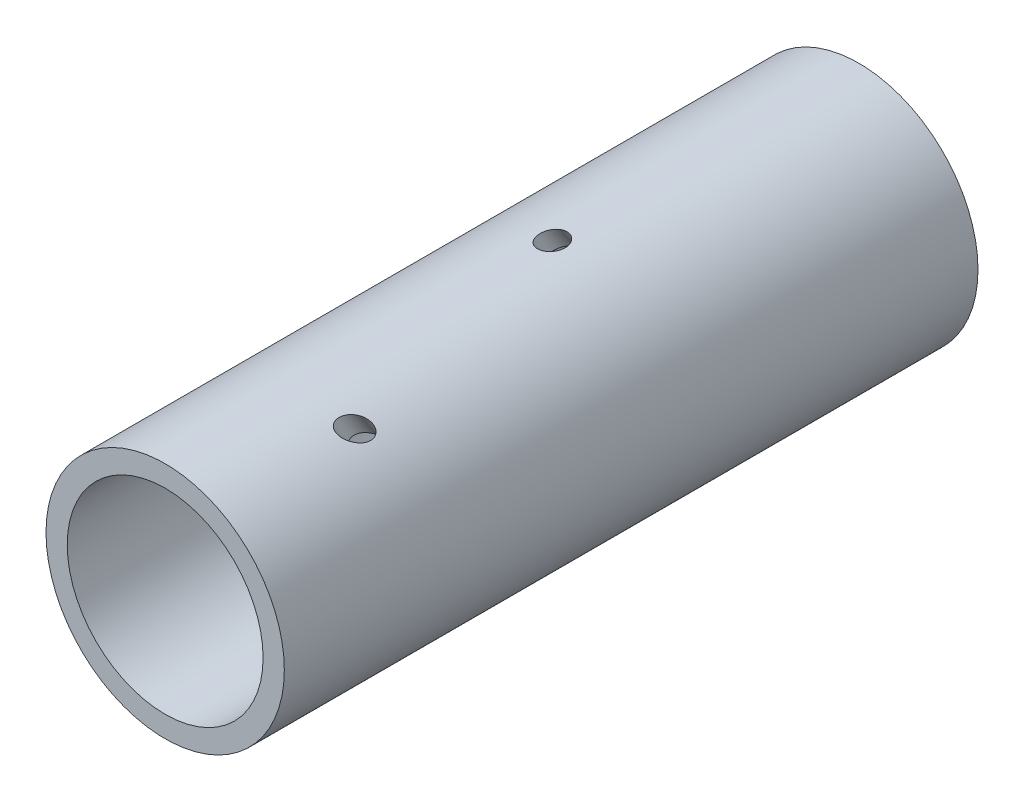
ISO-10303-21;
HEADER;
FILE_DESCRIPTION(('STEP AP214'),'2;1');
FILE_NAME('part.step','',(''),(''),'','','');
FILE_SCHEMA(('AUTOMOTIVE_DESIGN { 1 0 10303 214 1 1 1 1 }'));
ENDSEC;
DATA;
#1=APPLICATION_CONTEXT('core data for automotive mechanical design processes');
#2=APPLICATION_PROTOCOL_DEFINITION('international standard','automotive_design',2000,#1);
#3=PRODUCT_CONTEXT('',#1,'mechanical');
#4=PRODUCT('Part','Part','',(#3));
#5=PRODUCT_RELATED_PRODUCT_CATEGORY('part','',(#4));
#6=PRODUCT_DEFINITION_FORMATION('','',#4);
#7=PRODUCT_DEFINITION_CONTEXT('part definition',#1,'design');
#8=PRODUCT_DEFINITION('design','',#6,#7);
#9=PRODUCT_DEFINITION_SHAPE('','',#8);
#10=(LENGTH_UNIT() NAMED_UNIT(*) SI_UNIT(.MILLI.,.METRE.));
#11=(NAMED_UNIT(*) PLANE_ANGLE_UNIT() SI_UNIT($,.RADIAN.));
#12=(NAMED_UNIT(*) SI_UNIT($,.STERADIAN.) SOLID_ANGLE_UNIT());
#13=UNCERTAINTY_MEASURE_WITH_UNIT(LENGTH_MEASURE(1.E-05),#10,'distance_accuracy_value','');
#14=(GEOMETRIC_REPRESENTATION_CONTEXT(3) GLOBAL_UNCERTAINTY_ASSIGNED_CONTEXT((#13)) GLOBAL_UNIT_ASSIGNED_CONTEXT((#10,
#11,#12)) REPRESENTATION_CONTEXT('',''));
#15=CARTESIAN_POINT('',(0.,0.,0.));
#16=DIRECTION('',(0.,0.,1.));
#17=DIRECTION('',(1.,0.,0.));
#18=AXIS2_PLACEMENT_3D('',#15,#16,#17);
#19=CARTESIAN_POINT('',(0.,0.,-160.));
#20=DIRECTION('',(0.,0.,1.));
#21=DIRECTION('',(1.,0.,0.));
#22=AXIS2_PLACEMENT_3D('',#19,#20,#21);
#23=CYLINDRICAL_SURFACE('',#22,27.4847120291252);
#24=CARTESIAN_POINT('',(12.,24.7266939828991,-34.9456370238918));
#25=CARTESIAN_POINT('',(11.7955708249704,24.8258992898025,-34.8812020468948));
#26=CARTESIAN_POINT('',(11.5955446780501,24.9198092982787,-34.7932395773549));
#27=CARTESIAN_POINT('',(11.2109651697006,25.095195384678,-34.5784941975373));
#28=CARTESIAN_POINT('',(11.0264811015751,25.1766169830245,-34.4515480643789));
#29=CARTESIAN_POINT('',(10.6954998761636,25.3188628108949,-34.1798916483134));
#30=CARTESIAN_POINT('',(10.5470500342363,25.3809285034147,-34.0381874462833));
#31=CARTESIAN_POINT('',(10.269976929588,25.494300928506,-33.733263632902));
#32=CARTESIAN_POINT('',(10.1413274978308,25.5456218946599,-33.570072957874));
#33=CARTESIAN_POINT('',(9.88837173104402,25.6447004464521,-33.1997393759058));
#34=CARTESIAN_POINT('',(9.76764640163629,25.690753383683,-32.989679593373));
#35=CARTESIAN_POINT('',(9.55921491481743,25.7690368715095,-32.5509885763538));
#36=CARTESIAN_POINT('',(9.47155722202075,25.8012471435532,-32.3223306756956));
#37=CARTESIAN_POINT('',(9.33185583829653,25.8521094148291,-31.846386337746));
#38=CARTESIAN_POINT('',(9.28078041505836,25.8703935535314,-31.5987730182853));
#39=CARTESIAN_POINT('',(9.2233138395935,25.8909441069003,-31.0977749538082));
#40=CARTESIAN_POINT('',(9.2168341830568,25.8932422473153,-30.8444026418292));
#41=CARTESIAN_POINT('',(9.24830988124669,25.8820050510869,-30.4255473961526));
#42=CARTESIAN_POINT('',(9.2722183454226,25.8734762132452,-30.2588302903308));
#43=CARTESIAN_POINT('',(9.34469723681307,25.847390323043,-29.9315586531899));
#44=CARTESIAN_POINT('',(9.39322917747836,25.829847359238,-29.7709949240819));
#45=CARTESIAN_POINT('',(9.50492524362057,25.7889236181791,-29.4910533610005));
#46=CARTESIAN_POINT('',(9.56358762659526,25.7672738419107,-29.3696284583038));
#47=CARTESIAN_POINT('',(9.69867486437258,25.7167316844931,-29.1385256785147));
#48=CARTESIAN_POINT('',(9.77509211224047,25.6878424046382,-29.0288427999579));
#49=CARTESIAN_POINT('',(9.90267095742686,25.638810251719,-28.8763654380417));
#50=CARTESIAN_POINT('',(9.94759207860225,25.6214235494928,-28.8273510515158));
#51=CARTESIAN_POINT('',(10.0414583124602,25.5847815994874,-28.7341258656499));
#52=CARTESIAN_POINT('',(10.0904013471117,25.5655273157292,-28.689912612748));
#53=CARTESIAN_POINT('',(10.1919380144637,25.5252183367274,-28.6068686755786));
#54=CARTESIAN_POINT('',(10.2445298778981,25.5041645129228,-28.5680354096291));
#55=CARTESIAN_POINT('',(10.3528777409592,25.4603759115396,-28.4962122743712));
#56=CARTESIAN_POINT('',(10.408633308717,25.4376413632644,-28.4632216100264));
#57=CARTESIAN_POINT('',(10.5647461140931,25.3733509264549,-28.3814812851253));
#58=CARTESIAN_POINT('',(10.6677964657911,25.3302308399738,-28.3389435836878));
#59=CARTESIAN_POINT('',(10.8783773503723,25.2405114443628,-28.2734211497042));
#60=CARTESIAN_POINT('',(10.9859080036067,25.1939120417437,-28.2504369427659));
#61=CARTESIAN_POINT('',(11.2016476157382,25.098731132209,-28.2234018528171));
#62=CARTESIAN_POINT('',(11.3098492011861,25.0501624550321,-28.2192436649234));
#63=CARTESIAN_POINT('',(11.5249892848535,24.9519148283754,-28.2279518166846));
#64=CARTESIAN_POINT('',(11.6319271955642,24.9022353912971,-28.2408257832759));
#65=CARTESIAN_POINT('',(11.8937846137145,24.7785615099282,-28.291461031125));
#66=CARTESIAN_POINT('',(12.046903948498,24.7044245013548,-28.3382457884954));
#67=CARTESIAN_POINT('',(12.3431993551965,24.5577358566803,-28.4583478158386));
#68=CARTESIAN_POINT('',(12.4863498886673,24.4851885968545,-28.5317304448703));
#69=CARTESIAN_POINT('',(12.8145406835066,24.3154883871874,-28.7322129279527));
#70=CARTESIAN_POINT('',(12.9943237291229,24.2196916559873,-28.8691095953941));
#71=CARTESIAN_POINT('',(13.2463471017963,24.0822112190257,-29.0969994949733));
#72=CARTESIAN_POINT('',(13.3274772904965,24.0373830959166,-29.1768012951227));
#73=CARTESIAN_POINT('',(13.4838809747125,23.9499970083862,-29.3431183350693));
#74=CARTESIAN_POINT('',(13.5591550961517,23.9074388014991,-29.4296328554002));
#75=CARTESIAN_POINT('',(13.7801543421373,23.7812129377936,-29.7031030145794));
#76=CARTESIAN_POINT('',(13.9163924173563,23.7015601711072,-29.8997025205675));
#77=CARTESIAN_POINT('',(14.1627138464841,23.555199905367,-30.3130883987063));
#78=CARTESIAN_POINT('',(14.2727950331606,23.4884934790677,-30.5298764415109));
#79=CARTESIAN_POINT('',(14.415082763019,23.4012343288209,-30.8644526396012));
#80=CARTESIAN_POINT('',(14.4582935218309,23.3745442601898,-30.9760620836376));
#81=CARTESIAN_POINT('',(14.5373717355321,23.3254447931094,-31.2027601763979));
#82=CARTESIAN_POINT('',(14.5732383797131,23.3030358672687,-31.3178492076218));
#83=CARTESIAN_POINT('',(14.6688452637292,23.2430665079406,-31.6674421002643));
#84=CARTESIAN_POINT('',(14.7167963018549,23.2126371392349,-31.9067429441766));
#85=CARTESIAN_POINT('',(14.765252041185,23.1818297480203,-32.3186374234289));
#86=CARTESIAN_POINT('',(14.7756957745772,23.1751618774581,-32.4896202978354));
#87=CARTESIAN_POINT('',(14.7742355116691,23.1760963796053,-32.8315186936626));
#88=CARTESIAN_POINT('',(14.7623669178112,23.1836761459234,-33.0024338921303));
#89=CARTESIAN_POINT('',(14.7177427703326,23.2120216354176,-33.3044668115145));
#90=CARTESIAN_POINT('',(14.6897635610048,23.2297683930794,-33.4365653084111));
#91=CARTESIAN_POINT('',(14.6157013885103,23.2764387772188,-33.6937034872516));
#92=CARTESIAN_POINT('',(14.5696291433585,23.3053557864588,-33.8187472982117));
#93=CARTESIAN_POINT('',(14.4863314636669,23.3571541470674,-33.9977918934698));
#94=CARTESIAN_POINT('',(14.4560310361939,23.3759283405731,-34.0562981154197));
#95=CARTESIAN_POINT('',(14.3907641329581,23.4161648992198,-34.1696560734085));
#96=CARTESIAN_POINT('',(14.3557999639054,23.437625935115,-34.2245095961106));
#97=CARTESIAN_POINT('',(14.2813769436791,23.483048400002,-34.3299531352142));
#98=CARTESIAN_POINT('',(14.2419190772075,23.5070092811078,-34.3805440814609));
#99=CARTESIAN_POINT('',(14.1588186398716,23.55715626362,-34.4769276809257));
#100=CARTESIAN_POINT('',(14.115176541628,23.5833421136721,-34.5227208748433));
#101=CARTESIAN_POINT('',(13.9900123666801,23.6579265985789,-34.6413422045742));
#102=CARTESIAN_POINT('',(13.9045271555583,23.708318296418,-34.708841932907));
#103=CARTESIAN_POINT('',(13.7245452229196,23.8129605248731,-34.8263796806803));
#104=CARTESIAN_POINT('',(13.6300484220337,23.8672110894748,-34.8764175463083));
#105=CARTESIAN_POINT('',(13.4335635946111,23.9783580646483,-34.9594211200534));
#106=CARTESIAN_POINT('',(13.3314962721449,24.0352791772272,-34.9921641020596));
#107=CARTESIAN_POINT('',(13.1235382734901,24.1494562533742,-35.0403304941527));
#108=CARTESIAN_POINT('',(13.0176450101173,24.2067124207267,-35.0557419491596));
#109=CARTESIAN_POINT('',(12.7887300493108,24.3285211243894,-35.0714990831533));
#110=CARTESIAN_POINT('',(12.6654605919391,24.3929213488688,-35.06932266079));
#111=CARTESIAN_POINT('',(12.419566716489,24.5190300152509,-35.045868380455));
#112=CARTESIAN_POINT('',(12.2969418192183,24.5807408185037,-35.0246076481223));
#113=CARTESIAN_POINT('',(12.1167764737964,24.6697686488168,-34.9804242457842));
#114=CARTESIAN_POINT('',(12.0582097414888,24.6984459832272,-34.9639844214845));
#115=CARTESIAN_POINT('',(12.,24.7266939828991,-34.9456370238918));
#116=B_SPLINE_CURVE_WITH_KNOTS('',3,(#24,#25,#26,#27,#28,#29,#30,#31,#32,#33,#34,#35,#36,#37,
#38,#39,#40,#41,#42,#43,#44,#45,#46,#47,#48,#49,#50,#51,#52,#53,#54,#55,#56,#57,#58,#59,#60,#61,
#62,#63,#64,#65,#66,#67,#68,#69,#70,#71,#72,#73,#74,#75,#76,#77,#78,#79,#80,#81,#82,#83,#84,#85,
#86,#87,#88,#89,#90,#91,#92,#93,#94,#95,#96,#97,#98,#99,#100,#101,#102,#103,#104,#105,#106,#107,
#108,#109,#110,#111,#112,#113,#114,#115),.UNSPECIFIED.,.T.,.F.,(4,2,2,2,2,2,2,2,2,2,2,2,2,2,2,2,
2,2,2,2,2,2,2,2,2,2,2,2,2,2,2,2,2,2,2,2,2,2,2,2,2,2,2,2,2,4),(0.,0.708329155830534,
1.41966545163005,2.06052589135333,2.70053193267752,3.43705824586125,4.17465987168699,
4.93112757940473,5.68609357490438,6.19024755863515,6.69361596496059,7.10180729555275,
7.5098240611697,7.71572779273169,7.92152579947564,8.12722470578747,8.33289559992982,
8.68956130736689,9.04623660185228,9.40087633141199,9.75567492110521,10.282019644625,
10.8096666245821,11.5417350657747,11.9084219702008,12.2750696274285,13.0286586296692,
13.7823100488676,14.1498655268837,14.5174615570757,15.2510829010945,15.7638014053779,
16.2757070778647,16.6827567741881,17.0895657038662,17.2948347115928,17.5000025661247,
17.7051255485062,17.9102253889113,18.2683884520687,18.6265546700212,18.9892273918821,
19.3521501278991,19.7679480317669,20.1833731847253,20.3850648319369),.UNSPECIFIED.);
#117=CARTESIAN_POINT('',(12.,24.7266939828991,-34.9456370238918));
#118=VERTEX_POINT('',#117);
#119=EDGE_CURVE('E75',#118,#118,#116,.T.);
#120=ORIENTED_EDGE('',*,*,#119,.F.);
#121=EDGE_LOOP('',(#120));
#122=FACE_BOUND('',#121,.T.);
#123=CARTESIAN_POINT('',(0.,27.4847120291252,-92.6858449496621));
#124=CARTESIAN_POINT('',(-0.146551207208986,27.4847107952847,-92.6858382949386));
#125=CARTESIAN_POINT('',(-0.293356246275081,27.4835253918456,-92.6731226789664));
#126=CARTESIAN_POINT('',(-0.582812829421428,27.4789155068457,-92.6227567891551));
#127=CARTESIAN_POINT('',(-0.725452847520742,27.4754853324695,-92.5850431162557));
#128=CARTESIAN_POINT('',(-1.00192944488051,27.4667910296521,-92.4864265997963));
#129=CARTESIAN_POINT('',(-1.13579094359879,27.4615323856443,-92.4255930533221));
#130=CARTESIAN_POINT('',(-1.39178819800885,27.4497499245402,-92.2832179156056));
#131=CARTESIAN_POINT('',(-1.51392893590623,27.4432266486012,-92.2016851772898));
#132=CARTESIAN_POINT('',(-1.74865774712732,27.4292904397175,-92.0172779068338));
#133=CARTESIAN_POINT('',(-1.86068328660558,27.4218526485745,-91.9136917635453));
#134=CARTESIAN_POINT('',(-2.06777464365778,27.4070156566451,-91.6907929868975));
#135=CARTESIAN_POINT('',(-2.16283324678167,27.3996164735672,-91.5714737010217));
#136=CARTESIAN_POINT('',(-2.34426097292143,27.3847222986895,-91.3070514039489));
#137=CARTESIAN_POINT('',(-2.42860238803292,27.3773022611776,-91.1605555512414));
#138=CARTESIAN_POINT('',(-2.57488411427528,27.3639317778745,-90.85674837633));
#139=CARTESIAN_POINT('',(-2.636813298324,27.3579820625232,-90.6994317278836));
#140=CARTESIAN_POINT('',(-2.74533999002296,27.3473199194071,-90.3558966240522));
#141=CARTESIAN_POINT('',(-2.78871771891717,27.342884852792,-90.1686526170321));
#142=CARTESIAN_POINT('',(-2.8475284761413,27.3368217127966,-89.7898086481029));
#143=CARTESIAN_POINT('',(-2.86294821944162,27.3351949738905,-89.5982066591367));
#144=CARTESIAN_POINT('',(-2.86690986239638,27.3347814174029,-89.1898313431235));
#145=CARTESIAN_POINT('',(-2.85170662853498,27.336390269477,-88.9730161891119));
#146=CARTESIAN_POINT('',(-2.78764209249116,27.3429964069701,-88.5442884813147));
#147=CARTESIAN_POINT('',(-2.73874737599309,27.3479970562062,-88.3323810106871));
#148=CARTESIAN_POINT('',(-2.60363007920297,27.3612033352,-87.9058105441133));
#149=CARTESIAN_POINT('',(-2.5152189912789,27.3695935843023,-87.6918390084227));
#150=CARTESIAN_POINT('',(-2.30107908355317,27.3884273283071,-87.2835397199876));
#151=CARTESIAN_POINT('',(-2.17540322763378,27.3988679020477,-87.0891846086931));
#152=CARTESIAN_POINT('',(-1.92795161692218,27.4172042646745,-86.7805955716831));
#153=CARTESIAN_POINT('',(-1.8150496190552,27.4249884377208,-86.6592142825406));
#154=CARTESIAN_POINT('',(-1.57103846432102,27.4400458639739,-86.4363517369935));
#155=CARTESIAN_POINT('',(-1.43995586738585,27.4473198395974,-86.3348419628302));
#156=CARTESIAN_POINT('',(-1.18341955009049,27.4594736316788,-86.1710801241865));
#157=CARTESIAN_POINT('',(-1.06032019291999,27.4645500564261,-86.1051652553994));
#158=CARTESIAN_POINT('',(-0.804788853679,27.4732233748871,-85.9946629593384));
#159=CARTESIAN_POINT('',(-0.672361490086302,27.4768209948378,-85.9500650616023));
#160=CARTESIAN_POINT('',(-0.400943971687852,27.4821236530477,-85.8848760903085));
#161=CARTESIAN_POINT('',(-0.261925503980471,27.4838195740198,-85.8644006431399));
#162=CARTESIAN_POINT('',(0.0175118908121204,27.4850611067416,-85.849377103876));
#163=CARTESIAN_POINT('',(0.157930446693615,27.4846072740804,-85.8548223127682));
#164=CARTESIAN_POINT('',(0.4239051637837,27.4817385197339,-85.8896842095331));
#165=CARTESIAN_POINT('',(0.549734010000816,27.4794879200185,-85.9170929900774));
#166=CARTESIAN_POINT('',(0.795301173206202,27.4734779840948,-85.9916995917142));
#167=CARTESIAN_POINT('',(0.915038640196276,27.4697184379735,-86.0389001661296));
#168=CARTESIAN_POINT('',(1.15122065299612,27.4608575940975,-86.1532102210388));
#169=CARTESIAN_POINT('',(1.26727060737774,27.4557032504541,-86.2211243945348));
#170=CARTESIAN_POINT('',(1.48833281657552,27.4446085072127,-86.3728944847752));
#171=CARTESIAN_POINT('',(1.59334023414813,27.4386677656815,-86.4567573431245));
#172=CARTESIAN_POINT('',(1.80712273241719,27.4254797870299,-86.6519320008815));
#173=CARTESIAN_POINT('',(1.91383998937599,27.4181750480848,-86.7654881022153));
#174=CARTESIAN_POINT('',(2.11053645649531,27.4037364064875,-87.0062444392373));
#175=CARTESIAN_POINT('',(2.20050480126045,27.3966026173301,-87.1334534481117));
#176=CARTESIAN_POINT('',(2.38000117701192,27.3816488274696,-87.4251215382133));
#177=CARTESIAN_POINT('',(2.46575992681858,27.3739818525706,-87.5919109282922));
#178=CARTESIAN_POINT('',(2.61270525987933,27.3603471615809,-87.9360425972619));
#179=CARTESIAN_POINT('',(2.6738756868055,27.354380563509,-88.1133917271065));
#180=CARTESIAN_POINT('',(2.77954464630598,27.3438632050103,-88.5048984161965));
#181=CARTESIAN_POINT('',(2.81959182444317,27.3397117245817,-88.7202802114943));
#182=CARTESIAN_POINT('',(2.86528522569694,27.3349602389076,-89.1548400295962));
#183=CARTESIAN_POINT('',(2.8709057578767,27.3343628859446,-89.374020765081));
#184=CARTESIAN_POINT('',(2.84590867864696,27.3369789666767,-89.8223920475712));
#185=CARTESIAN_POINT('',(2.81330011833747,27.3404017863507,-90.0514773804734));
#186=CARTESIAN_POINT('',(2.70701339810382,27.3511306478845,-90.4998060284321));
#187=CARTESIAN_POINT('',(2.63338650571881,27.3584318417562,-90.7190612609405));
#188=CARTESIAN_POINT('',(2.4654869551733,27.3740043447845,-91.0919072649221));
#189=CARTESIAN_POINT('',(2.3794508249141,27.3816985181094,-91.2492551564379));
#190=CARTESIAN_POINT('',(2.1824218775498,27.3981052308583,-91.5476234873268));
#191=CARTESIAN_POINT('',(2.0714430314002,27.4068171988865,-91.688653000247));
#192=CARTESIAN_POINT('',(1.88722566043506,27.4199122702404,-91.8840299497803));
#193=CARTESIAN_POINT('',(1.82259520169298,27.4242977345014,-91.9466580087095));
#194=CARTESIAN_POINT('',(1.68779680482982,27.432923570073,-92.0656328634029));
#195=CARTESIAN_POINT('',(1.61763160147399,27.4371640115741,-92.1219827284816));
#196=CARTESIAN_POINT('',(1.47217250962246,27.4453531673976,-92.2277217849541));
#197=CARTESIAN_POINT('',(1.3968763048207,27.449301748265,-92.2771078013408));
#198=CARTESIAN_POINT('',(1.2417627818732,27.456755887195,-92.3682127117593));
#199=CARTESIAN_POINT('',(1.16194630993003,27.4602615277823,-92.4099330346574));
#200=CARTESIAN_POINT('',(1.0079124067118,27.4663202221443,-92.4807666487179));
#201=CARTESIAN_POINT('',(0.934109586109702,27.4689364946398,-92.5107786850396));
#202=CARTESIAN_POINT('',(0.784066643749814,27.4736285323072,-92.5639639826442));
#203=CARTESIAN_POINT('',(0.707826873137782,27.4757043749602,-92.5871382243212));
#204=CARTESIAN_POINT('',(0.553739764842208,27.4792410894502,-92.6263033502298));
#205=CARTESIAN_POINT('',(0.475897516081357,27.4807036639694,-92.642314131552));
#206=CARTESIAN_POINT('',(0.319092073227113,27.4829713665281,-92.6670319637783));
#207=CARTESIAN_POINT('',(0.24012973470269,27.4837769714927,-92.6757443130817));
#208=CARTESIAN_POINT('',(0.13416781825378,27.484397640871,-92.6824513767934));
#209=CARTESIAN_POINT('',(0.107350673252122,27.484515424719,-92.6837233866979));
#210=CARTESIAN_POINT('',(0.0536918589941192,27.4846727319071,-92.6854207831047));
#211=CARTESIAN_POINT('',(0.0268501897172702,27.4847122551817,-92.6858461688986));
#212=CARTESIAN_POINT('',(0.,27.4847120291252,-92.6858449496621));
#213=B_SPLINE_CURVE_WITH_KNOTS('',3,(#123,#124,#125,#126,#127,#128,#129,#130,#131,#132,#133,
#134,#135,#136,#137,#138,#139,#140,#141,#142,#143,#144,#145,#146,#147,#148,#149,#150,#151,#152,
#153,#154,#155,#156,#157,#158,#159,#160,#161,#162,#163,#164,#165,#166,#167,#168,#169,#170,#171,
#172,#173,#174,#175,#176,#177,#178,#179,#180,#181,#182,#183,#184,#185,#186,#187,#188,#189,#190,
#191,#192,#193,#194,#195,#196,#197,#198,#199,#200,#201,#202,#203,#204,#205,#206,#207,#208,#209,
#210,#211,#212),.UNSPECIFIED.,.T.,.F.,(4,2,2,2,2,2,2,2,2,2,2,2,2,2,2,2,2,2,2,2,2,2,2,2,2,2,2,2,
2,2,2,2,2,2,2,2,2,2,2,2,2,2,2,2,4),(0.,0.439549123730933,0.880217301451505,1.31957495220496,
1.75874500783049,2.21513932295012,2.6717272399367,3.17732099960709,3.68316543001465,
4.25763525650966,4.83237798716243,5.48165898456336,6.13158485015554,6.82310172698012,
7.51364043373123,8.00966035566383,8.50496313150515,8.92240527943679,9.33964217704612,
9.75887098710997,10.1779914562988,10.5626491098194,10.9473602925133,11.34949100202,
11.7517971396473,12.2180996810323,12.6847036771835,13.2456791797217,13.8070226840437,
14.4615220016165,15.1165096808515,15.8071813146197,16.496991629807,17.0333468721356,
17.5694024356896,17.8393915770553,18.1092481401738,18.3792273431214,18.6491561714485,
18.8879813377077,19.1267722448656,19.3648957096304,19.6028461551463,19.6833775114583,
19.7639089351634),.UNSPECIFIED.);
#214=CARTESIAN_POINT('',(0.,27.4847120291252,-92.6858449496621));
#215=VERTEX_POINT('',#214);
#216=EDGE_CURVE('E55',#215,#215,#213,.T.);
#217=ORIENTED_EDGE('',*,*,#216,.F.);
#218=EDGE_LOOP('',(#217));
#219=FACE_BOUND('',#218,.T.);
#220=CARTESIAN_POINT('',(0.,0.,-160.));
#221=DIRECTION('',(0.,0.,1.));
#222=DIRECTION('',(1.,0.,0.));
#223=AXIS2_PLACEMENT_3D('',#220,#221,#222);
#224=CIRCLE('',#223,27.4847120291252);
#225=CARTESIAN_POINT('',(27.4847120291252,0.,-160.));
#226=VERTEX_POINT('',#225);
#227=EDGE_CURVE('E10',#226,#226,#224,.T.);
#228=ORIENTED_EDGE('',*,*,#227,.T.);
#229=EDGE_LOOP('',(#228));
#230=FACE_BOUND('',#229,.T.);
#231=CARTESIAN_POINT('',(0.,0.,0.));
#232=DIRECTION('',(0.,0.,1.));
#233=DIRECTION('',(1.,0.,0.));
#234=AXIS2_PLACEMENT_3D('',#231,#232,#233);
#235=CIRCLE('',#234,27.4847120291252);
#236=CARTESIAN_POINT('',(27.4847120291252,0.,0.));
#237=VERTEX_POINT('',#236);
#238=EDGE_CURVE('E34',#237,#237,#235,.T.);
#239=ORIENTED_EDGE('',*,*,#238,.F.);
#240=EDGE_LOOP('',(#239));
#241=FACE_BOUND('',#240,.T.);
#242=ADVANCED_FACE('F31',(#122,#219,#230,#241),#23,.T.);
#243=CARTESIAN_POINT('',(0.,0.,-160.));
#244=DIRECTION('',(0.,0.,1.));
#245=DIRECTION('',(1.,0.,0.));
#246=AXIS2_PLACEMENT_3D('',#243,#244,#245);
#247=PLANE('',#246);
#248=CARTESIAN_POINT('',(0.,0.,-160.));
#249=DIRECTION('',(0.,0.,1.));
#250=DIRECTION('',(1.,0.,0.));
#251=AXIS2_PLACEMENT_3D('',#248,#249,#250);
#252=CIRCLE('',#251,22.5873627702995);
#253=CARTESIAN_POINT('',(22.5873627702995,0.,-160.));
#254=VERTEX_POINT('',#253);
#255=EDGE_CURVE('E41',#254,#254,#252,.T.);
#256=ORIENTED_EDGE('',*,*,#255,.T.);
#257=EDGE_LOOP('',(#256));
#258=FACE_BOUND('',#257,.T.);
#259=ORIENTED_EDGE('',*,*,#227,.F.);
#260=EDGE_LOOP('',(#259));
#261=FACE_BOUND('',#260,.T.);
#262=ADVANCED_FACE('F90',(#258,#261),#247,.F.);
#263=CARTESIAN_POINT('',(0.,0.,0.));
#264=DIRECTION('',(0.,0.,1.));
#265=DIRECTION('',(1.,0.,0.));
#266=AXIS2_PLACEMENT_3D('',#263,#264,#265);
#267=PLANE('',#266);
#268=CARTESIAN_POINT('',(0.,0.,0.));
#269=DIRECTION('',(0.,0.,1.));
#270=DIRECTION('',(1.,0.,0.));
#271=AXIS2_PLACEMENT_3D('',#268,#269,#270);
#272=CIRCLE('',#271,22.5873627702995);
#273=CARTESIAN_POINT('',(22.5873627702995,0.,0.));
#274=VERTEX_POINT('',#273);
#275=EDGE_CURVE('E43',#274,#274,#272,.T.);
#276=ORIENTED_EDGE('',*,*,#275,.F.);
#277=EDGE_LOOP('',(#276));
#278=FACE_BOUND('',#277,.T.);
#279=ORIENTED_EDGE('',*,*,#238,.T.);
#280=EDGE_LOOP('',(#279));
#281=FACE_BOUND('',#280,.T.);
#282=ADVANCED_FACE('F95',(#278,#281),#267,.T.);
#283=CARTESIAN_POINT('',(0.,0.,-160.));
#284=DIRECTION('',(0.,0.,1.));
#285=DIRECTION('',(1.,0.,0.));
#286=AXIS2_PLACEMENT_3D('',#283,#284,#285);
#287=CYLINDRICAL_SURFACE('',#286,22.5873627702995);
#288=CARTESIAN_POINT('',(12.,19.1360643006108,-38.5762343903252));
#289=CARTESIAN_POINT('',(11.8119549441276,19.2539814688202,-38.4996571308469));
#290=CARTESIAN_POINT('',(11.6274796987068,19.3657777500779,-38.4042764656331));
#291=CARTESIAN_POINT('',(11.2701420237613,19.5759061935409,-38.1815234625094));
#292=CARTESIAN_POINT('',(11.0973125162659,19.6742009393027,-38.0540648868865));
#293=CARTESIAN_POINT('',(10.7562885311521,19.862821018779,-37.7620682293081));
#294=CARTESIAN_POINT('',(10.5891915105636,19.9521627355482,-37.5956100500443));
#295=CARTESIAN_POINT('',(10.277469308237,20.1145103733189,-37.2359539391941));
#296=CARTESIAN_POINT('',(10.1328431313905,20.1875170177729,-37.0427571924265));
#297=CARTESIAN_POINT('',(9.85788203043789,20.323307885702,-36.6142948568403));
#298=CARTESIAN_POINT('',(9.73023048934223,20.3844502934906,-36.3767737527975));
#299=CARTESIAN_POINT('',(9.51344618347249,20.4865263977049,-35.8805862116739));
#300=CARTESIAN_POINT('',(9.42429759683685,20.5274683959889,-35.6219285122292));
#301=CARTESIAN_POINT('',(9.30711686192968,20.5808064943971,-35.1524633938389));
#302=CARTESIAN_POINT('',(9.26970294727571,20.5976221059104,-34.9444806723298));
#303=CARTESIAN_POINT('',(9.22576261862787,20.617345818913,-34.5245878191061));
#304=CARTESIAN_POINT('',(9.21919277439569,20.6202734755081,-34.3126836316746));
#305=CARTESIAN_POINT('',(9.23884457446581,20.6114707805035,-33.9406291043925));
#306=CARTESIAN_POINT('',(9.25772563959797,20.6030222179609,-33.780014831631));
#307=CARTESIAN_POINT('',(9.31848799764292,20.5756144085131,-33.4640632556008));
#308=CARTESIAN_POINT('',(9.36033906241333,20.5566689750074,-33.3087193013461));
#309=CARTESIAN_POINT('',(9.45794509080678,20.5119100157234,-33.0393515352967));
#310=CARTESIAN_POINT('',(9.50916402134439,20.4882662044166,-32.9233335065388));
#311=CARTESIAN_POINT('',(9.62790220700693,20.432737251575,-32.7020263096615));
#312=CARTESIAN_POINT('',(9.69541184887269,20.4008569696565,-32.5967308659889));
#313=CARTESIAN_POINT('',(9.84674134126784,20.3282490395264,-32.4005046847906));
#314=CARTESIAN_POINT('',(9.93068488562622,20.2874540032042,-32.3096930084859));
#315=CARTESIAN_POINT('',(10.1122067622164,20.1975842477554,-32.1479941497517));
#316=CARTESIAN_POINT('',(10.2097740200186,20.1485162468929,-32.0770909237162));
#317=CARTESIAN_POINT('',(10.4014661886329,20.0501506328883,-31.9658037476047));
#318=CARTESIAN_POINT('',(10.4944424916893,20.0016808064893,-31.9226803816519));
#319=CARTESIAN_POINT('',(10.6846632676058,19.9007164511913,-31.8543838717236));
#320=CARTESIAN_POINT('',(10.7819082754753,19.8482214171816,-31.8292129846444));
#321=CARTESIAN_POINT('',(10.9791836346574,19.7397907746545,-31.7958384300749));
#322=CARTESIAN_POINT('',(11.0792339244803,19.6838161692867,-31.7878874256855));
#323=CARTESIAN_POINT('',(11.2784121678723,19.5703745486762,-31.7879744215563));
#324=CARTESIAN_POINT('',(11.3775396459797,19.5129068163038,-31.7960202504175));
#325=CARTESIAN_POINT('',(11.630132390306,19.3639131104279,-31.8347961804835));
#326=CARTESIAN_POINT('',(11.7817524929011,19.2719733495986,-31.875979754398));
#327=CARTESIAN_POINT('',(12.0756188676795,19.0892265864933,-31.9855984237286));
#328=CARTESIAN_POINT('',(12.2178390203195,18.9984232657914,-32.0541060150687));
#329=CARTESIAN_POINT('',(12.4564082706087,18.8425480201116,-32.1920050566803));
#330=CARTESIAN_POINT('',(12.5551612524949,18.7768540392561,-32.256655805986));
#331=CARTESIAN_POINT('',(12.7467582029263,18.6473186242164,-32.3959021304302));
#332=CARTESIAN_POINT('',(12.839599298455,18.5834780988378,-32.4705024871309));
#333=CARTESIAN_POINT('',(13.019495971042,18.4578909302964,-32.6283110181214));
#334=CARTESIAN_POINT('',(13.1065413632832,18.3961480619653,-32.7115337211528));
#335=CARTESIAN_POINT('',(13.2747329110293,18.2751512787036,-32.8853706185574));
#336=CARTESIAN_POINT('',(13.3558794920564,18.215897184371,-32.9759842787669));
#337=CARTESIAN_POINT('',(13.5344517264361,18.0837814770492,-33.1903105192199));
#338=CARTESIAN_POINT('',(13.6299980292714,18.0118060549204,-33.3161406709225));
#339=CARTESIAN_POINT('',(13.8114766742628,17.8730277021316,-33.5772928509017));
#340=CARTESIAN_POINT('',(13.8974052178235,17.8062268183736,-33.7126185954334));
#341=CARTESIAN_POINT('',(14.0592889994574,17.67868654095,-33.9916855727342));
#342=CARTESIAN_POINT('',(14.1352508232978,17.6179431510724,-34.1354211567533));
#343=CARTESIAN_POINT('',(14.2766547923829,17.5035523606619,-34.4306298656018));
#344=CARTESIAN_POINT('',(14.3421022826986,17.4499013571135,-34.5820990070565));
#345=CARTESIAN_POINT('',(14.4411800482279,17.3678983566485,-34.8394902592935));
#346=CARTESIAN_POINT('',(14.4780661931987,17.3371434505866,-34.9434055060376));
#347=CARTESIAN_POINT('',(14.5463635472669,17.2798799037062,-35.1541543339256));
#348=CARTESIAN_POINT('',(14.5777761020535,17.2533702193246,-35.2609871902791));
#349=CARTESIAN_POINT('',(14.6345122939026,17.2052721558025,-35.4771918251648));
#350=CARTESIAN_POINT('',(14.6598447928854,17.1836766165164,-35.5865596505729));
#351=CARTESIAN_POINT('',(14.7037065055097,17.1461600102378,-35.8075763922233));
#352=CARTESIAN_POINT('',(14.7222382497719,17.1302368325744,-35.9192244436145));
#353=CARTESIAN_POINT('',(14.7570381147817,17.100278186824,-36.1864449319947));
#354=CARTESIAN_POINT('',(14.7698725393653,17.0891716753408,-36.3428405862504));
#355=CARTESIAN_POINT('',(14.7776314101426,17.0824662404934,-36.6564526140125));
#356=CARTESIAN_POINT('',(14.7725830318327,17.0868437868569,-36.8136673799957));
#357=CARTESIAN_POINT('',(14.744401877902,17.1111601264732,-37.0886985249654));
#358=CARTESIAN_POINT('',(14.7256830373956,17.1272990567189,-37.2072800380512));
#359=CARTESIAN_POINT('',(14.6737022329427,17.1718550636309,-37.4388708671607));
#360=CARTESIAN_POINT('',(14.6404528569949,17.2002615125296,-37.5518849122701));
#361=CARTESIAN_POINT('',(14.5582321433456,17.2699085160307,-37.7690342697848));
#362=CARTESIAN_POINT('',(14.5091388968569,17.3112485082331,-37.8730925410846));
#363=CARTESIAN_POINT('',(14.3959436493979,17.4054914121902,-38.0668235069238));
#364=CARTESIAN_POINT('',(14.3318470859294,17.4583901343693,-38.1565013934076));
#365=CARTESIAN_POINT('',(14.1994038514147,17.5662250747644,-38.3085457319429));
#366=CARTESIAN_POINT('',(14.1324918573796,17.6201537959294,-38.3728986872185));
#367=CARTESIAN_POINT('',(13.9908878751091,17.732799971631,-38.4871596118197));
#368=CARTESIAN_POINT('',(13.9161947431508,17.7915181298746,-38.5370654535279));
#369=CARTESIAN_POINT('',(13.7566797195737,17.9151741960394,-38.625025154835));
#370=CARTESIAN_POINT('',(13.671522314934,17.9802755805247,-38.662231796839));
#371=CARTESIAN_POINT('',(13.4969954261875,18.1116552559735,-38.7216315347799));
#372=CARTESIAN_POINT('',(13.4076222616747,18.1779345425841,-38.7438112425007));
#373=CARTESIAN_POINT('',(13.1772411213988,18.3460913174486,-38.7827172484084));
#374=CARTESIAN_POINT('',(13.034494276868,18.447798506805,-38.7899770367158));
#375=CARTESIAN_POINT('',(12.7476580073154,18.6471668054095,-38.7764974973071));
#376=CARTESIAN_POINT('',(12.6035674799173,18.7448241530458,-38.755732714473));
#377=CARTESIAN_POINT('',(12.3828838705262,18.890786691823,-38.7052119629121));
#378=CARTESIAN_POINT('',(12.3056173007094,18.9412006373279,-38.683936320571));
#379=CARTESIAN_POINT('',(12.1520413756965,19.0400942291027,-38.6348644168406));
#380=CARTESIAN_POINT('',(12.0757311929474,19.0885756401084,-38.6070742716825));
#381=CARTESIAN_POINT('',(12.,19.1360643006108,-38.5762343903252));
#382=B_SPLINE_CURVE_WITH_KNOTS('',3,(#288,#289,#290,#291,#292,#293,#294,#295,#296,#297,#298,
#299,#300,#301,#302,#303,#304,#305,#306,#307,#308,#309,#310,#311,#312,#313,#314,#315,#316,#317,
#318,#319,#320,#321,#322,#323,#324,#325,#326,#327,#328,#329,#330,#331,#332,#333,#334,#335,#336,
#337,#338,#339,#340,#341,#342,#343,#344,#345,#346,#347,#348,#349,#350,#351,#352,#353,#354,#355,
#356,#357,#358,#359,#360,#361,#362,#363,#364,#365,#366,#367,#368,#369,#370,#371,#372,#373,#374,
#375,#376,#377,#378,#379,#380,#381),.UNSPECIFIED.,.T.,.F.,(4,2,2,2,2,2,2,2,2,2,2,2,2,2,2,2,2,2,
2,2,2,2,2,2,2,2,2,2,2,2,2,2,2,2,2,2,2,2,2,2,2,2,2,2,2,2,4),(0.,0.70407079224405,1.4100550022389,
2.16362085563681,2.91715332828654,3.74263990870955,4.56778695181727,5.20145449171142,
5.83422952285497,6.3183578292666,6.80185055307333,7.1873680290276,7.57265856245454,
7.96096904899113,8.34896570403097,8.68746692498846,9.02601069313802,9.36948909642891,
9.71313563407613,10.2561798389356,10.8006745334221,11.2054047765949,11.6103302298136,
12.0159494393595,12.4215393596827,12.9417383856225,13.4621421478514,13.9822002892526,
14.5019932113396,14.8452102696644,15.1883428282121,15.5309721783398,15.8734739034804,
16.3439640736281,16.8137395730798,17.1757553271036,17.5374580817817,17.902013061168,
18.2664361225524,18.5870973609186,18.9078057988689,19.2469682324726,19.5864324461681,
20.1098305804525,20.6337044448302,20.9175195586241,21.2010692683927),.UNSPECIFIED.);
#383=CARTESIAN_POINT('',(12.,19.1360643006108,-38.5762343903252));
#384=VERTEX_POINT('',#383);
#385=EDGE_CURVE('E79',#384,#384,#382,.T.);
#386=ORIENTED_EDGE('',*,*,#385,.T.);
#387=EDGE_LOOP('',(#386));
#388=FACE_BOUND('',#387,.T.);
#389=CARTESIAN_POINT('',(0.,22.5873627702995,-95.8662207448837));
#390=CARTESIAN_POINT('',(-0.147548924993024,22.5873610010742,-95.8662132679045));
#391=CARTESIAN_POINT('',(-0.295337698222331,22.5858994180583,-95.8534975841059));
#392=CARTESIAN_POINT('',(-0.586756310954915,22.5802133025772,-95.80309489258));
#393=CARTESIAN_POINT('',(-0.730375272827437,22.5759821220265,-95.7653477971025));
#394=CARTESIAN_POINT('',(-1.00882070614247,22.5652520783558,-95.6665226905557));
#395=CARTESIAN_POINT('',(-1.14366957073607,22.5587592832907,-95.6055070692891));
#396=CARTESIAN_POINT('',(-1.40152230149209,22.5442098647942,-95.462529963413));
#397=CARTESIAN_POINT('',(-1.52453110829651,22.5361538979157,-95.3805772680907));
#398=CARTESIAN_POINT('',(-1.76024628327041,22.5189910120958,-95.1954420867576));
#399=CARTESIAN_POINT('',(-1.8724496092892,22.5098573924351,-95.0916237258946));
#400=CARTESIAN_POINT('',(-2.07967610174746,22.4916595829105,-94.8680883377382));
#401=CARTESIAN_POINT('',(-2.17469251928507,22.4825954216535,-94.748365096834));
#402=CARTESIAN_POINT('',(-2.35489740525882,22.4644703246732,-94.4841605503558));
#403=CARTESIAN_POINT('',(-2.43821981202569,22.4554961561338,-94.3384032273815));
#404=CARTESIAN_POINT('',(-2.58248883732364,22.4393622614092,-94.0361482418758));
#405=CARTESIAN_POINT('',(-2.64342475863611,22.4322034031616,-93.8796454870014));
#406=CARTESIAN_POINT('',(-2.74964726662481,22.419448225098,-93.5387581336537));
#407=CARTESIAN_POINT('',(-2.7918507013007,22.4141780772872,-93.3534015353344));
#408=CARTESIAN_POINT('',(-2.84876144745807,22.407014702817,-92.9784828743504));
#409=CARTESIAN_POINT('',(-2.863455920362,22.4051230529392,-92.7889188898152));
#410=CARTESIAN_POINT('',(-2.86650378204594,22.4047352400331,-92.3842406206624));
#411=CARTESIAN_POINT('',(-2.85107956694367,22.4067259823478,-92.1690931492437));
#412=CARTESIAN_POINT('',(-2.7873036745555,22.4147472429759,-91.7436379282982));
#413=CARTESIAN_POINT('',(-2.73891790327691,22.4207819440779,-91.5333354232702));
#414=CARTESIAN_POINT('',(-2.60499452338337,22.4367531934419,-91.1073124189094));
#415=CARTESIAN_POINT('',(-2.51691606327322,22.4469511039247,-90.8923920005368));
#416=CARTESIAN_POINT('',(-2.30367873480052,22.4698352191946,-90.4819202109852));
#417=CARTESIAN_POINT('',(-2.17856896173258,22.4825181219549,-90.286343649314));
#418=CARTESIAN_POINT('',(-1.93200866543361,22.50482082045,-89.9751465457454));
#419=CARTESIAN_POINT('',(-1.81939285263925,22.5143008598459,-89.8524941745847));
#420=CARTESIAN_POINT('',(-1.57579950424404,22.5326579350443,-89.6269730953236));
#421=CARTESIAN_POINT('',(-1.44484973434935,22.5415358530921,-89.5240750191197));
#422=CARTESIAN_POINT('',(-1.18947717937456,22.5563209879452,-89.3585790878666));
#423=CARTESIAN_POINT('',(-1.06757404378779,22.562476697714,-89.2921277423502));
#424=CARTESIAN_POINT('',(-0.814328691753976,22.5730333782246,-89.1802927126091));
#425=CARTESIAN_POINT('',(-0.682991490973522,22.5774352733592,-89.1348979279093));
#426=CARTESIAN_POINT('',(-0.413509299314201,22.5839809338259,-89.0679656104176));
#427=CARTESIAN_POINT('',(-0.275332418558082,22.58611282061,-89.0465535449253));
#428=CARTESIAN_POINT('',(0.00260904409136068,22.5877894864584,-89.0296823218519));
#429=CARTESIAN_POINT('',(0.142373136335065,22.5873350428612,-89.0342153662993));
#430=CARTESIAN_POINT('',(0.406331649090263,22.5840595614864,-89.0672886478687));
#431=CARTESIAN_POINT('',(0.530808471781102,22.5814517522102,-89.0936664572204));
#432=CARTESIAN_POINT('',(0.773848223959066,22.5744304624199,-89.1659846433859));
#433=CARTESIAN_POINT('',(0.892410250138923,22.5700167070432,-89.2119279980932));
#434=CARTESIAN_POINT('',(1.12640259417276,22.5595772552437,-89.3234301831151));
#435=CARTESIAN_POINT('',(1.24144892983541,22.5534876988756,-89.3897819943107));
#436=CARTESIAN_POINT('',(1.46080657995993,22.540343839937,-89.5381863338209));
#437=CARTESIAN_POINT('',(1.56511313736165,22.5332891130498,-89.6202457740291));
#438=CARTESIAN_POINT('',(1.77850696095887,22.5175300517869,-89.81195609677));
#439=CARTESIAN_POINT('',(1.8854992721594,22.5087466150329,-89.9239260761547));
#440=CARTESIAN_POINT('',(2.08310499698805,22.4913201386902,-90.1614603247245));
#441=CARTESIAN_POINT('',(2.17370746680564,22.4826771963916,-90.2870335882821));
#442=CARTESIAN_POINT('',(2.35584910155342,22.4643946148449,-90.5763688815145));
#443=CARTESIAN_POINT('',(2.4435154028124,22.4549320819329,-90.7425834035695));
#444=CARTESIAN_POINT('',(2.59449877930764,22.4379876355125,-91.0858180296531));
#445=CARTESIAN_POINT('',(2.65779914004332,22.4305070826915,-91.2628454549824));
#446=CARTESIAN_POINT('',(2.76857625370734,22.4171280125914,-91.6550209730084));
#447=CARTESIAN_POINT('',(2.81146843280629,22.4117218309738,-91.8714945469927));
#448=CARTESIAN_POINT('',(2.86259534034292,22.4052484827107,-92.3087096255269));
#449=CARTESIAN_POINT('',(2.87080408574883,22.4041845690876,-92.529454205376));
#450=CARTESIAN_POINT('',(2.85063269036374,22.4067626924976,-92.9805372061586));
#451=CARTESIAN_POINT('',(2.82038571825185,22.4106448563594,-93.2107977868596));
#452=CARTESIAN_POINT('',(2.71824014128689,22.4232647565512,-93.6617288337896));
#453=CARTESIAN_POINT('',(2.64639849032827,22.4319958527707,-93.8824119707431));
#454=CARTESIAN_POINT('',(2.48171968994785,22.4507264232768,-94.2561173308185));
#455=CARTESIAN_POINT('',(2.39753094952502,22.4599704353941,-94.4130154893144));
#456=CARTESIAN_POINT('',(2.2042320100024,22.4797626008304,-94.7107423594525));
#457=CARTESIAN_POINT('',(2.09513630277907,22.490309994159,-94.8515803443778));
#458=CARTESIAN_POINT('',(1.91380840401658,22.5062213008951,-95.0469231827144));
#459=CARTESIAN_POINT('',(1.85016976690378,22.5115585385953,-95.1095720042949));
#460=CARTESIAN_POINT('',(1.71737258352966,22.5220785480182,-95.2287137491024));
#461=CARTESIAN_POINT('',(1.64821669665222,22.5272613925256,-95.2852096074455));
#462=CARTESIAN_POINT('',(1.50478960316612,22.5372965104929,-95.391397463918));
#463=CARTESIAN_POINT('',(1.43051592110717,22.5421486216896,-95.4410861342293));
#464=CARTESIAN_POINT('',(1.27745174362549,22.5513402519531,-95.5329865795622));
#465=CARTESIAN_POINT('',(1.19866201140095,22.5556798572547,-95.5751996130403));
#466=CARTESIAN_POINT('',(1.04598461568158,22.56324594169,-95.6474403765144));
#467=CARTESIAN_POINT('',(0.972489421398491,22.5665420628958,-95.6782924743394));
#468=CARTESIAN_POINT('',(0.82299549168431,22.5724882943965,-95.7332465577543));
#469=CARTESIAN_POINT('',(0.746997082925781,22.5751384886095,-95.7573494202577));
#470=CARTESIAN_POINT('',(0.593302728543401,22.5796998364527,-95.7984699549024));
#471=CARTESIAN_POINT('',(0.515611792434113,22.5816129221053,-95.8155061584513));
#472=CARTESIAN_POINT('',(0.359016904114397,22.5846449738025,-95.8423728295455));
#473=CARTESIAN_POINT('',(0.28011380419262,22.5857644738678,-95.8522081428708));
#474=CARTESIAN_POINT('',(0.167520836928325,22.5867663212261,-95.8609975842837));
#475=CARTESIAN_POINT('',(0.134047717287845,22.586989748431,-95.8629553251942));
#476=CARTESIAN_POINT('',(0.0670538612503706,22.5872881741166,-95.8655677560539));
#477=CARTESIAN_POINT('',(0.0335331247861128,22.5873631723874,-95.8662224441606));
#478=CARTESIAN_POINT('',(0.,22.5873627702995,-95.8662207448837));
#479=B_SPLINE_CURVE_WITH_KNOTS('',3,(#389,#390,#391,#392,#393,#394,#395,#396,#397,#398,#399,
#400,#401,#402,#403,#404,#405,#406,#407,#408,#409,#410,#411,#412,#413,#414,#415,#416,#417,#418,
#419,#420,#421,#422,#423,#424,#425,#426,#427,#428,#429,#430,#431,#432,#433,#434,#435,#436,#437,
#438,#439,#440,#441,#442,#443,#444,#445,#446,#447,#448,#449,#450,#451,#452,#453,#454,#455,#456,
#457,#458,#459,#460,#461,#462,#463,#464,#465,#466,#467,#468,#469,#470,#471,#472,#473,#474,#475,
#476,#477,#478),.UNSPECIFIED.,.T.,.F.,(4,2,2,2,2,2,2,2,2,2,2,2,2,2,2,2,2,2,2,2,2,2,2,2,2,2,2,2,
2,2,2,2,2,2,2,2,2,2,2,2,2,2,2,2,4),(0.,0.442518173871349,0.886102473921879,1.32850566188604,
1.77072343533068,2.22822587619143,2.68590757952583,3.18828724218063,3.69090665200592,
4.25916821863113,4.82769492987328,5.47210456388297,6.11718176115099,6.81121530281814,
7.50433280041881,8.00284900330721,8.50061823870397,8.91582952778001,9.33082167871748,
9.74797489517122,10.1650027400996,10.5450851740968,10.9252254776655,11.3225536670196,
11.7200570979589,12.1837359653376,12.6477233062709,13.2100686049128,13.772798975539,
14.4321727627435,15.0920404311438,15.7851989364816,16.4774105653012,17.0101700004867,
17.542620241225,17.8106876186053,18.078626555875,18.3466960160961,18.6147203062398,
18.8537341611106,19.0927169470088,19.3310690075199,19.5692605231715,19.6698305284268,
19.7704006758898),.UNSPECIFIED.);
#480=CARTESIAN_POINT('',(0.,22.5873627702995,-95.8662207448837));
#481=VERTEX_POINT('',#480);
#482=EDGE_CURVE('E46',#481,#481,#479,.T.);
#483=ORIENTED_EDGE('',*,*,#482,.T.);
#484=EDGE_LOOP('',(#483));
#485=FACE_BOUND('',#484,.T.);
#486=ORIENTED_EDGE('',*,*,#255,.F.);
#487=EDGE_LOOP('',(#486));
#488=FACE_BOUND('',#487,.T.);
#489=ORIENTED_EDGE('',*,*,#275,.T.);
#490=EDGE_LOOP('',(#489));
#491=FACE_BOUND('',#490,.T.);
#492=ADVANCED_FACE('F60',(#388,#485,#488,#491),#287,.F.);
#493=CARTESIAN_POINT('',(0.,0.,-107.118504804248));
#494=DIRECTION('',(0.,-0.838670567945423,-0.544639035015028));
#495=DIRECTION('',(0.,0.544639035015028,-0.838670567945423));
#496=AXIS2_PLACEMENT_3D('',#493,#494,#495);
#497=CYLINDRICAL_SURFACE('',#496,2.86499999999999);
#498=ORIENTED_EDGE('',*,*,#216,.T.);
#499=EDGE_LOOP('',(#498));
#500=FACE_BOUND('',#499,.T.);
#501=ORIENTED_EDGE('',*,*,#482,.F.);
#502=EDGE_LOOP('',(#501));
#503=FACE_BOUND('',#502,.T.);
#504=ADVANCED_FACE('F63',(#500,#503),#497,.F.);
#505=CARTESIAN_POINT('',(12.,-1.98313330773016,-48.9823935418008));
#506=DIRECTION('',(0.,-0.838670567945423,-0.544639035015028));
#507=DIRECTION('',(0.,0.544639035015028,-0.838670567945423));
#508=AXIS2_PLACEMENT_3D('',#505,#506,#507);
#509=CYLINDRICAL_SURFACE('',#508,2.775);
#510=ORIENTED_EDGE('',*,*,#119,.T.);
#511=EDGE_LOOP('',(#510));
#512=FACE_BOUND('',#511,.T.);
#513=ORIENTED_EDGE('',*,*,#385,.F.);
#514=EDGE_LOOP('',(#513));
#515=FACE_BOUND('',#514,.T.);
#516=ADVANCED_FACE('F67',(#512,#515),#509,.F.);
#517=CLOSED_SHELL('',(#242,#262,#282,#492,#504,#516));
#518=MANIFOLD_SOLID_BREP('B2',#517);
#519=ADVANCED_BREP_SHAPE_REPRESENTATION('',(#18,#518),#14);
#520=SHAPE_DEFINITION_REPRESENTATION(#9,#519);
ENDSEC;
END-ISO-10303-21;
